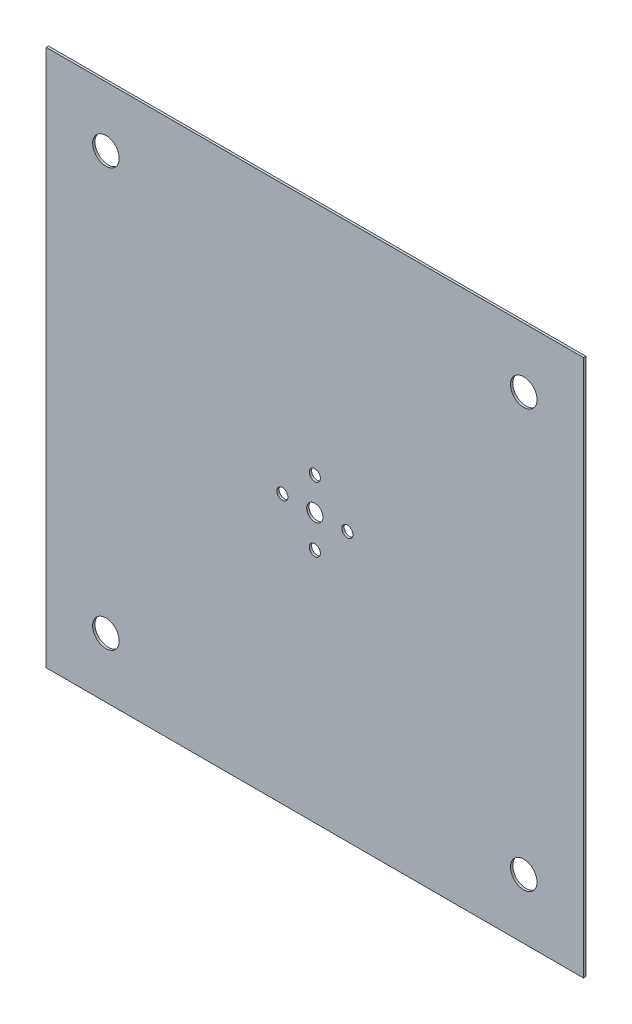
ISO-10303-21;
HEADER;
FILE_DESCRIPTION(('STEP AP214'),'2;1');
FILE_NAME('part.step','',(''),(''),'','','');
FILE_SCHEMA(('AUTOMOTIVE_DESIGN { 1 0 10303 214 1 1 1 1 }'));
ENDSEC;
DATA;
#1=APPLICATION_CONTEXT('core data for automotive mechanical design processes');
#2=APPLICATION_PROTOCOL_DEFINITION('international standard','automotive_design',2000,#1);
#3=PRODUCT_CONTEXT('',#1,'mechanical');
#4=PRODUCT('Part','Part','',(#3));
#5=PRODUCT_RELATED_PRODUCT_CATEGORY('part','',(#4));
#6=PRODUCT_DEFINITION_FORMATION('','',#4);
#7=PRODUCT_DEFINITION_CONTEXT('part definition',#1,'design');
#8=PRODUCT_DEFINITION('design','',#6,#7);
#9=PRODUCT_DEFINITION_SHAPE('','',#8);
#10=(LENGTH_UNIT() NAMED_UNIT(*) SI_UNIT(.MILLI.,.METRE.));
#11=(NAMED_UNIT(*) PLANE_ANGLE_UNIT() SI_UNIT($,.RADIAN.));
#12=(NAMED_UNIT(*) SI_UNIT($,.STERADIAN.) SOLID_ANGLE_UNIT());
#13=UNCERTAINTY_MEASURE_WITH_UNIT(LENGTH_MEASURE(1.E-05),#10,'distance_accuracy_value','');
#14=(GEOMETRIC_REPRESENTATION_CONTEXT(3) GLOBAL_UNCERTAINTY_ASSIGNED_CONTEXT((#13)) GLOBAL_UNIT_ASSIGNED_CONTEXT((#10,
#11,#12)) REPRESENTATION_CONTEXT('',''));
#15=CARTESIAN_POINT('',(0.,0.,0.));
#16=DIRECTION('',(0.,0.,1.));
#17=DIRECTION('',(1.,0.,0.));
#18=AXIS2_PLACEMENT_3D('',#15,#16,#17);
#19=CARTESIAN_POINT('',(1157.4,1157.4,10.));
#20=DIRECTION('',(-1.,0.,0.));
#21=DIRECTION('',(0.,-1.,0.));
#22=AXIS2_PLACEMENT_3D('',#19,#20,#21);
#23=PLANE('',#22);
#24=DIRECTION('',(0.,1.,0.));
#25=VECTOR('',#24,1.);
#26=CARTESIAN_POINT('',(1157.4,1157.4,0.));
#27=LINE('',#26,#25);
#28=CARTESIAN_POINT('',(1157.4,-1157.4,0.));
#29=VERTEX_POINT('',#28);
#30=CARTESIAN_POINT('',(1157.4,1157.4,0.));
#31=VERTEX_POINT('',#30);
#32=EDGE_CURVE('E102',#29,#31,#27,.T.);
#33=ORIENTED_EDGE('',*,*,#32,.T.);
#34=DIRECTION('',(0.,0.,-1.));
#35=VECTOR('',#34,1.);
#36=CARTESIAN_POINT('',(1157.4,1157.4,10.));
#37=LINE('',#36,#35);
#38=CARTESIAN_POINT('',(1157.4,1157.4,10.));
#39=VERTEX_POINT('',#38);
#40=EDGE_CURVE('E11',#39,#31,#37,.T.);
#41=ORIENTED_EDGE('',*,*,#40,.F.);
#42=DIRECTION('',(0.,1.,0.));
#43=VECTOR('',#42,1.);
#44=CARTESIAN_POINT('',(1157.4,1157.4,10.));
#45=LINE('',#44,#43);
#46=CARTESIAN_POINT('',(1157.4,-1157.4,10.));
#47=VERTEX_POINT('',#46);
#48=EDGE_CURVE('E90',#47,#39,#45,.T.);
#49=ORIENTED_EDGE('',*,*,#48,.F.);
#50=DIRECTION('',(0.,0.,-1.));
#51=VECTOR('',#50,1.);
#52=CARTESIAN_POINT('',(1157.4,-1157.4,10.));
#53=LINE('',#52,#51);
#54=EDGE_CURVE('E98',#47,#29,#53,.T.);
#55=ORIENTED_EDGE('',*,*,#54,.T.);
#56=EDGE_LOOP('',(#33,#41,#49,#55));
#57=FACE_BOUND('',#56,.T.);
#58=ADVANCED_FACE('F39',(#57),#23,.F.);
#59=CARTESIAN_POINT('',(-1157.4,1157.4,10.));
#60=DIRECTION('',(0.,-1.,0.));
#61=DIRECTION('',(0.,0.,-1.));
#62=AXIS2_PLACEMENT_3D('',#59,#60,#61);
#63=PLANE('',#62);
#64=DIRECTION('',(-1.,0.,0.));
#65=VECTOR('',#64,1.);
#66=CARTESIAN_POINT('',(-1157.4,1157.4,0.));
#67=LINE('',#66,#65);
#68=CARTESIAN_POINT('',(-1157.4,1157.4,0.));
#69=VERTEX_POINT('',#68);
#70=EDGE_CURVE('E94',#31,#69,#67,.T.);
#71=ORIENTED_EDGE('',*,*,#70,.T.);
#72=DIRECTION('',(0.,0.,-1.));
#73=VECTOR('',#72,1.);
#74=CARTESIAN_POINT('',(-1157.4,1157.4,10.));
#75=LINE('',#74,#73);
#76=CARTESIAN_POINT('',(-1157.4,1157.4,10.));
#77=VERTEX_POINT('',#76);
#78=EDGE_CURVE('E47',#77,#69,#75,.T.);
#79=ORIENTED_EDGE('',*,*,#78,.F.);
#80=DIRECTION('',(-1.,0.,0.));
#81=VECTOR('',#80,1.);
#82=CARTESIAN_POINT('',(-1157.4,1157.4,10.));
#83=LINE('',#82,#81);
#84=EDGE_CURVE('E85',#39,#77,#83,.T.);
#85=ORIENTED_EDGE('',*,*,#84,.F.);
#86=ORIENTED_EDGE('',*,*,#40,.T.);
#87=EDGE_LOOP('',(#71,#79,#85,#86));
#88=FACE_BOUND('',#87,.T.);
#89=ADVANCED_FACE('F93',(#88),#63,.F.);
#90=CARTESIAN_POINT('',(-1157.4,1157.4,10.));
#91=DIRECTION('',(1.,0.,0.));
#92=DIRECTION('',(0.,1.,0.));
#93=AXIS2_PLACEMENT_3D('',#90,#91,#92);
#94=PLANE('',#93);
#95=DIRECTION('',(0.,-1.,0.));
#96=VECTOR('',#95,1.);
#97=CARTESIAN_POINT('',(-1157.4,1157.4,0.));
#98=LINE('',#97,#96);
#99=CARTESIAN_POINT('',(-1157.4,-1157.4,0.));
#100=VERTEX_POINT('',#99);
#101=EDGE_CURVE('E72',#69,#100,#98,.T.);
#102=ORIENTED_EDGE('',*,*,#101,.T.);
#103=DIRECTION('',(0.,0.,-1.));
#104=VECTOR('',#103,1.);
#105=CARTESIAN_POINT('',(-1157.4,-1157.4,10.));
#106=LINE('',#105,#104);
#107=CARTESIAN_POINT('',(-1157.4,-1157.4,10.));
#108=VERTEX_POINT('',#107);
#109=EDGE_CURVE('E95',#108,#100,#106,.T.);
#110=ORIENTED_EDGE('',*,*,#109,.F.);
#111=DIRECTION('',(0.,-1.,0.));
#112=VECTOR('',#111,1.);
#113=CARTESIAN_POINT('',(-1157.4,1157.4,10.));
#114=LINE('',#113,#112);
#115=EDGE_CURVE('E88',#77,#108,#114,.T.);
#116=ORIENTED_EDGE('',*,*,#115,.F.);
#117=ORIENTED_EDGE('',*,*,#78,.T.);
#118=EDGE_LOOP('',(#102,#110,#116,#117));
#119=FACE_BOUND('',#118,.T.);
#120=ADVANCED_FACE('F96',(#119),#94,.F.);
#121=CARTESIAN_POINT('',(-1157.4,-1157.4,10.));
#122=DIRECTION('',(0.,1.,0.));
#123=DIRECTION('',(0.,0.,1.));
#124=AXIS2_PLACEMENT_3D('',#121,#122,#123);
#125=PLANE('',#124);
#126=DIRECTION('',(1.,0.,0.));
#127=VECTOR('',#126,1.);
#128=CARTESIAN_POINT('',(-1157.4,-1157.4,0.));
#129=LINE('',#128,#127);
#130=EDGE_CURVE('E78',#100,#29,#129,.T.);
#131=ORIENTED_EDGE('',*,*,#130,.T.);
#132=ORIENTED_EDGE('',*,*,#54,.F.);
#133=DIRECTION('',(1.,0.,0.));
#134=VECTOR('',#133,1.);
#135=CARTESIAN_POINT('',(-1157.4,-1157.4,10.));
#136=LINE('',#135,#134);
#137=EDGE_CURVE('E55',#108,#47,#136,.T.);
#138=ORIENTED_EDGE('',*,*,#137,.F.);
#139=ORIENTED_EDGE('',*,*,#109,.T.);
#140=EDGE_LOOP('',(#131,#132,#138,#139));
#141=FACE_BOUND('',#140,.T.);
#142=ADVANCED_FACE('F110',(#141),#125,.F.);
#143=CARTESIAN_POINT('',(0.,0.,10.));
#144=DIRECTION('',(0.,0.,1.));
#145=DIRECTION('',(1.,0.,0.));
#146=AXIS2_PLACEMENT_3D('',#143,#144,#145);
#147=PLANE('',#146);
#148=CARTESIAN_POINT('',(-140.,-1.38777878078145E-13,10.));
#149=DIRECTION('',(0.,0.,1.));
#150=DIRECTION('',(-1.,0.,0.));
#151=AXIS2_PLACEMENT_3D('',#148,#149,#150);
#152=CIRCLE('',#151,23.9);
#153=CARTESIAN_POINT('',(-163.9,-1.38777878078145E-13,10.));
#154=VERTEX_POINT('',#153);
#155=EDGE_CURVE('E137',#154,#154,#152,.T.);
#156=ORIENTED_EDGE('',*,*,#155,.F.);
#157=EDGE_LOOP('',(#156));
#158=FACE_BOUND('',#157,.T.);
#159=CARTESIAN_POINT('',(140.,0.,10.));
#160=DIRECTION('',(0.,0.,1.));
#161=DIRECTION('',(1.,0.,0.));
#162=AXIS2_PLACEMENT_3D('',#159,#160,#161);
#163=CIRCLE('',#162,23.9);
#164=CARTESIAN_POINT('',(163.9,0.,10.));
#165=VERTEX_POINT('',#164);
#166=EDGE_CURVE('E126',#165,#165,#163,.T.);
#167=ORIENTED_EDGE('',*,*,#166,.F.);
#168=EDGE_LOOP('',(#167));
#169=FACE_BOUND('',#168,.T.);
#170=CARTESIAN_POINT('',(1.24595565345252E-13,-140.,10.));
#171=DIRECTION('',(0.,0.,1.));
#172=DIRECTION('',(-1.,0.,0.));
#173=AXIS2_PLACEMENT_3D('',#170,#171,#172);
#174=CIRCLE('',#173,23.9);
#175=CARTESIAN_POINT('',(-23.8999999999999,-140.,10.));
#176=VERTEX_POINT('',#175);
#177=EDGE_CURVE('E125',#176,#176,#174,.T.);
#178=ORIENTED_EDGE('',*,*,#177,.F.);
#179=EDGE_LOOP('',(#178));
#180=FACE_BOUND('',#179,.T.);
#181=CARTESIAN_POINT('',(1.24595565345252E-13,140.,10.));
#182=DIRECTION('',(0.,0.,1.));
#183=DIRECTION('',(1.,0.,0.));
#184=AXIS2_PLACEMENT_3D('',#181,#182,#183);
#185=CIRCLE('',#184,23.9);
#186=CARTESIAN_POINT('',(23.9000000000001,140.,10.));
#187=VERTEX_POINT('',#186);
#188=EDGE_CURVE('E119',#187,#187,#185,.T.);
#189=ORIENTED_EDGE('',*,*,#188,.F.);
#190=EDGE_LOOP('',(#189));
#191=FACE_BOUND('',#190,.T.);
#192=CARTESIAN_POINT('',(-900.,900.,10.));
#193=DIRECTION('',(0.,0.,1.));
#194=DIRECTION('',(1.,0.,0.));
#195=AXIS2_PLACEMENT_3D('',#192,#193,#194);
#196=CIRCLE('',#195,57.15);
#197=CARTESIAN_POINT('',(-842.85,900.,10.));
#198=VERTEX_POINT('',#197);
#199=EDGE_CURVE('E138',#198,#198,#196,.T.);
#200=ORIENTED_EDGE('',*,*,#199,.F.);
#201=EDGE_LOOP('',(#200));
#202=FACE_BOUND('',#201,.T.);
#203=CARTESIAN_POINT('',(900.,900.,10.));
#204=DIRECTION('',(0.,0.,1.));
#205=DIRECTION('',(-1.,0.,0.));
#206=AXIS2_PLACEMENT_3D('',#203,#204,#205);
#207=CIRCLE('',#206,57.15);
#208=CARTESIAN_POINT('',(842.85,900.,10.));
#209=VERTEX_POINT('',#208);
#210=EDGE_CURVE('E161',#209,#209,#207,.T.);
#211=ORIENTED_EDGE('',*,*,#210,.F.);
#212=EDGE_LOOP('',(#211));
#213=FACE_BOUND('',#212,.T.);
#214=CARTESIAN_POINT('',(900.,-900.000000000001,10.));
#215=DIRECTION('',(0.,0.,1.));
#216=DIRECTION('',(1.,0.,0.));
#217=AXIS2_PLACEMENT_3D('',#214,#215,#216);
#218=CIRCLE('',#217,57.15);
#219=CARTESIAN_POINT('',(957.15,-900.000000000001,10.));
#220=VERTEX_POINT('',#219);
#221=EDGE_CURVE('E155',#220,#220,#218,.T.);
#222=ORIENTED_EDGE('',*,*,#221,.F.);
#223=EDGE_LOOP('',(#222));
#224=FACE_BOUND('',#223,.T.);
#225=CARTESIAN_POINT('',(-900.,-900.,10.));
#226=DIRECTION('',(0.,0.,1.));
#227=DIRECTION('',(-1.,0.,0.));
#228=AXIS2_PLACEMENT_3D('',#225,#226,#227);
#229=CIRCLE('',#228,57.15);
#230=CARTESIAN_POINT('',(-957.15,-900.,10.));
#231=VERTEX_POINT('',#230);
#232=EDGE_CURVE('E149',#231,#231,#229,.T.);
#233=ORIENTED_EDGE('',*,*,#232,.F.);
#234=EDGE_LOOP('',(#233));
#235=FACE_BOUND('',#234,.T.);
#236=CARTESIAN_POINT('',(0.,0.,10.));
#237=DIRECTION('',(0.,0.,1.));
#238=DIRECTION('',(1.,0.,0.));
#239=AXIS2_PLACEMENT_3D('',#236,#237,#238);
#240=CIRCLE('',#239,35.);
#241=CARTESIAN_POINT('',(35.,0.,10.));
#242=VERTEX_POINT('',#241);
#243=EDGE_CURVE('E116',#242,#242,#240,.T.);
#244=ORIENTED_EDGE('',*,*,#243,.F.);
#245=EDGE_LOOP('',(#244));
#246=FACE_BOUND('',#245,.T.);
#247=ORIENTED_EDGE('',*,*,#48,.T.);
#248=ORIENTED_EDGE('',*,*,#84,.T.);
#249=ORIENTED_EDGE('',*,*,#115,.T.);
#250=ORIENTED_EDGE('',*,*,#137,.T.);
#251=EDGE_LOOP('',(#247,#248,#249,#250));
#252=FACE_BOUND('',#251,.T.);
#253=ADVANCED_FACE('F86',(#158,#169,#180,#191,#202,#213,#224,#235,#246,#252),#147,.T.);
#254=CARTESIAN_POINT('',(0.,0.,0.));
#255=DIRECTION('',(0.,0.,1.));
#256=DIRECTION('',(1.,0.,0.));
#257=AXIS2_PLACEMENT_3D('',#254,#255,#256);
#258=PLANE('',#257);
#259=CARTESIAN_POINT('',(-140.,-1.38777878078145E-13,0.));
#260=DIRECTION('',(0.,0.,1.));
#261=DIRECTION('',(-1.,0.,0.));
#262=AXIS2_PLACEMENT_3D('',#259,#260,#261);
#263=CIRCLE('',#262,23.9);
#264=CARTESIAN_POINT('',(-163.9,-1.38777878078145E-13,0.));
#265=VERTEX_POINT('',#264);
#266=EDGE_CURVE('E134',#265,#265,#263,.T.);
#267=ORIENTED_EDGE('',*,*,#266,.T.);
#268=EDGE_LOOP('',(#267));
#269=FACE_BOUND('',#268,.T.);
#270=CARTESIAN_POINT('',(140.,0.,0.));
#271=DIRECTION('',(0.,0.,1.));
#272=DIRECTION('',(1.,0.,0.));
#273=AXIS2_PLACEMENT_3D('',#270,#271,#272);
#274=CIRCLE('',#273,23.9);
#275=CARTESIAN_POINT('',(163.9,0.,0.));
#276=VERTEX_POINT('',#275);
#277=EDGE_CURVE('E141',#276,#276,#274,.T.);
#278=ORIENTED_EDGE('',*,*,#277,.T.);
#279=EDGE_LOOP('',(#278));
#280=FACE_BOUND('',#279,.T.);
#281=CARTESIAN_POINT('',(1.24595565345252E-13,-140.,0.));
#282=DIRECTION('',(0.,0.,1.));
#283=DIRECTION('',(-1.,0.,0.));
#284=AXIS2_PLACEMENT_3D('',#281,#282,#283);
#285=CIRCLE('',#284,23.9);
#286=CARTESIAN_POINT('',(-23.8999999999999,-140.,0.));
#287=VERTEX_POINT('',#286);
#288=EDGE_CURVE('E122',#287,#287,#285,.T.);
#289=ORIENTED_EDGE('',*,*,#288,.T.);
#290=EDGE_LOOP('',(#289));
#291=FACE_BOUND('',#290,.T.);
#292=CARTESIAN_POINT('',(1.24595565345252E-13,140.,0.));
#293=DIRECTION('',(0.,0.,1.));
#294=DIRECTION('',(1.,0.,0.));
#295=AXIS2_PLACEMENT_3D('',#292,#293,#294);
#296=CIRCLE('',#295,23.9);
#297=CARTESIAN_POINT('',(23.9000000000001,140.,0.));
#298=VERTEX_POINT('',#297);
#299=EDGE_CURVE('E129',#298,#298,#296,.T.);
#300=ORIENTED_EDGE('',*,*,#299,.T.);
#301=EDGE_LOOP('',(#300));
#302=FACE_BOUND('',#301,.T.);
#303=CARTESIAN_POINT('',(-900.,900.,0.));
#304=DIRECTION('',(0.,0.,1.));
#305=DIRECTION('',(1.,0.,0.));
#306=AXIS2_PLACEMENT_3D('',#303,#304,#305);
#307=CIRCLE('',#306,57.15);
#308=CARTESIAN_POINT('',(-842.85,900.,0.));
#309=VERTEX_POINT('',#308);
#310=EDGE_CURVE('E164',#309,#309,#307,.T.);
#311=ORIENTED_EDGE('',*,*,#310,.T.);
#312=EDGE_LOOP('',(#311));
#313=FACE_BOUND('',#312,.T.);
#314=CARTESIAN_POINT('',(900.,900.,0.));
#315=DIRECTION('',(0.,0.,1.));
#316=DIRECTION('',(-1.,0.,0.));
#317=AXIS2_PLACEMENT_3D('',#314,#315,#316);
#318=CIRCLE('',#317,57.15);
#319=CARTESIAN_POINT('',(842.85,900.,0.));
#320=VERTEX_POINT('',#319);
#321=EDGE_CURVE('E158',#320,#320,#318,.T.);
#322=ORIENTED_EDGE('',*,*,#321,.T.);
#323=EDGE_LOOP('',(#322));
#324=FACE_BOUND('',#323,.T.);
#325=CARTESIAN_POINT('',(900.,-900.000000000001,0.));
#326=DIRECTION('',(0.,0.,1.));
#327=DIRECTION('',(1.,0.,0.));
#328=AXIS2_PLACEMENT_3D('',#325,#326,#327);
#329=CIRCLE('',#328,57.15);
#330=CARTESIAN_POINT('',(957.15,-900.000000000001,0.));
#331=VERTEX_POINT('',#330);
#332=EDGE_CURVE('E152',#331,#331,#329,.T.);
#333=ORIENTED_EDGE('',*,*,#332,.T.);
#334=EDGE_LOOP('',(#333));
#335=FACE_BOUND('',#334,.T.);
#336=CARTESIAN_POINT('',(-900.,-900.,0.));
#337=DIRECTION('',(0.,0.,1.));
#338=DIRECTION('',(-1.,0.,0.));
#339=AXIS2_PLACEMENT_3D('',#336,#337,#338);
#340=CIRCLE('',#339,57.15);
#341=CARTESIAN_POINT('',(-957.15,-900.,0.));
#342=VERTEX_POINT('',#341);
#343=EDGE_CURVE('E146',#342,#342,#340,.T.);
#344=ORIENTED_EDGE('',*,*,#343,.T.);
#345=EDGE_LOOP('',(#344));
#346=FACE_BOUND('',#345,.T.);
#347=CARTESIAN_POINT('',(0.,0.,0.));
#348=DIRECTION('',(0.,0.,1.));
#349=DIRECTION('',(1.,0.,0.));
#350=AXIS2_PLACEMENT_3D('',#347,#348,#349);
#351=CIRCLE('',#350,35.);
#352=CARTESIAN_POINT('',(35.,0.,0.));
#353=VERTEX_POINT('',#352);
#354=EDGE_CURVE('E105',#353,#353,#351,.T.);
#355=ORIENTED_EDGE('',*,*,#354,.T.);
#356=EDGE_LOOP('',(#355));
#357=FACE_BOUND('',#356,.T.);
#358=ORIENTED_EDGE('',*,*,#32,.F.);
#359=ORIENTED_EDGE('',*,*,#130,.F.);
#360=ORIENTED_EDGE('',*,*,#101,.F.);
#361=ORIENTED_EDGE('',*,*,#70,.F.);
#362=EDGE_LOOP('',(#358,#359,#360,#361));
#363=FACE_BOUND('',#362,.T.);
#364=ADVANCED_FACE('F113',(#269,#280,#291,#302,#313,#324,#335,#346,#357,#363),#258,.F.);
#365=CARTESIAN_POINT('',(0.,0.,0.));
#366=DIRECTION('',(0.,0.,1.));
#367=DIRECTION('',(1.,0.,0.));
#368=AXIS2_PLACEMENT_3D('',#365,#366,#367);
#369=CYLINDRICAL_SURFACE('',#368,35.);
#370=ORIENTED_EDGE('',*,*,#354,.F.);
#371=EDGE_LOOP('',(#370));
#372=FACE_BOUND('',#371,.T.);
#373=ORIENTED_EDGE('',*,*,#243,.T.);
#374=EDGE_LOOP('',(#373));
#375=FACE_BOUND('',#374,.T.);
#376=ADVANCED_FACE('F184',(#372,#375),#369,.F.);
#377=CARTESIAN_POINT('',(-900.,-900.,0.));
#378=DIRECTION('',(0.,0.,1.));
#379=DIRECTION('',(1.,0.,0.));
#380=AXIS2_PLACEMENT_3D('',#377,#378,#379);
#381=CYLINDRICAL_SURFACE('',#380,57.15);
#382=ORIENTED_EDGE('',*,*,#343,.F.);
#383=EDGE_LOOP('',(#382));
#384=FACE_BOUND('',#383,.T.);
#385=ORIENTED_EDGE('',*,*,#232,.T.);
#386=EDGE_LOOP('',(#385));
#387=FACE_BOUND('',#386,.T.);
#388=ADVANCED_FACE('F186',(#384,#387),#381,.F.);
#389=CARTESIAN_POINT('',(900.,-900.000000000001,0.));
#390=DIRECTION('',(0.,0.,1.));
#391=DIRECTION('',(1.,0.,0.));
#392=AXIS2_PLACEMENT_3D('',#389,#390,#391);
#393=CYLINDRICAL_SURFACE('',#392,57.15);
#394=ORIENTED_EDGE('',*,*,#332,.F.);
#395=EDGE_LOOP('',(#394));
#396=FACE_BOUND('',#395,.T.);
#397=ORIENTED_EDGE('',*,*,#221,.T.);
#398=EDGE_LOOP('',(#397));
#399=FACE_BOUND('',#398,.T.);
#400=ADVANCED_FACE('F193',(#396,#399),#393,.F.);
#401=CARTESIAN_POINT('',(900.,900.,0.));
#402=DIRECTION('',(0.,0.,1.));
#403=DIRECTION('',(1.,0.,0.));
#404=AXIS2_PLACEMENT_3D('',#401,#402,#403);
#405=CYLINDRICAL_SURFACE('',#404,57.15);
#406=ORIENTED_EDGE('',*,*,#321,.F.);
#407=EDGE_LOOP('',(#406));
#408=FACE_BOUND('',#407,.T.);
#409=ORIENTED_EDGE('',*,*,#210,.T.);
#410=EDGE_LOOP('',(#409));
#411=FACE_BOUND('',#410,.T.);
#412=ADVANCED_FACE('F247',(#408,#411),#405,.F.);
#413=CARTESIAN_POINT('',(-900.,900.,0.));
#414=DIRECTION('',(0.,0.,1.));
#415=DIRECTION('',(1.,0.,0.));
#416=AXIS2_PLACEMENT_3D('',#413,#414,#415);
#417=CYLINDRICAL_SURFACE('',#416,57.15);
#418=ORIENTED_EDGE('',*,*,#310,.F.);
#419=EDGE_LOOP('',(#418));
#420=FACE_BOUND('',#419,.T.);
#421=ORIENTED_EDGE('',*,*,#199,.T.);
#422=EDGE_LOOP('',(#421));
#423=FACE_BOUND('',#422,.T.);
#424=ADVANCED_FACE('F170',(#420,#423),#417,.F.);
#425=CARTESIAN_POINT('',(1.24595565345252E-13,140.,0.));
#426=DIRECTION('',(0.,0.,1.));
#427=DIRECTION('',(1.,0.,0.));
#428=AXIS2_PLACEMENT_3D('',#425,#426,#427);
#429=CYLINDRICAL_SURFACE('',#428,23.9);
#430=ORIENTED_EDGE('',*,*,#299,.F.);
#431=EDGE_LOOP('',(#430));
#432=FACE_BOUND('',#431,.T.);
#433=ORIENTED_EDGE('',*,*,#188,.T.);
#434=EDGE_LOOP('',(#433));
#435=FACE_BOUND('',#434,.T.);
#436=ADVANCED_FACE('F268',(#432,#435),#429,.F.);
#437=CARTESIAN_POINT('',(1.24595565345252E-13,-140.,0.));
#438=DIRECTION('',(0.,0.,1.));
#439=DIRECTION('',(1.,0.,0.));
#440=AXIS2_PLACEMENT_3D('',#437,#438,#439);
#441=CYLINDRICAL_SURFACE('',#440,23.9);
#442=ORIENTED_EDGE('',*,*,#288,.F.);
#443=EDGE_LOOP('',(#442));
#444=FACE_BOUND('',#443,.T.);
#445=ORIENTED_EDGE('',*,*,#177,.T.);
#446=EDGE_LOOP('',(#445));
#447=FACE_BOUND('',#446,.T.);
#448=ADVANCED_FACE('F279',(#444,#447),#441,.F.);
#449=CARTESIAN_POINT('',(140.,0.,0.));
#450=DIRECTION('',(0.,0.,1.));
#451=DIRECTION('',(1.,0.,0.));
#452=AXIS2_PLACEMENT_3D('',#449,#450,#451);
#453=CYLINDRICAL_SURFACE('',#452,23.9);
#454=ORIENTED_EDGE('',*,*,#277,.F.);
#455=EDGE_LOOP('',(#454));
#456=FACE_BOUND('',#455,.T.);
#457=ORIENTED_EDGE('',*,*,#166,.T.);
#458=EDGE_LOOP('',(#457));
#459=FACE_BOUND('',#458,.T.);
#460=ADVANCED_FACE('F290',(#456,#459),#453,.F.);
#461=CARTESIAN_POINT('',(-140.,-1.38777878078145E-13,0.));
#462=DIRECTION('',(0.,0.,1.));
#463=DIRECTION('',(1.,0.,0.));
#464=AXIS2_PLACEMENT_3D('',#461,#462,#463);
#465=CYLINDRICAL_SURFACE('',#464,23.9);
#466=ORIENTED_EDGE('',*,*,#266,.F.);
#467=EDGE_LOOP('',(#466));
#468=FACE_BOUND('',#467,.T.);
#469=ORIENTED_EDGE('',*,*,#155,.T.);
#470=EDGE_LOOP('',(#469));
#471=FACE_BOUND('',#470,.T.);
#472=ADVANCED_FACE('F300',(#468,#471),#465,.F.);
#473=CLOSED_SHELL('',(#58,#89,#120,#142,#253,#364,#376,#388,#400,#412,#424,#436,#448,#460,#472));
#474=MANIFOLD_SOLID_BREP('B2',#473);
#475=ADVANCED_BREP_SHAPE_REPRESENTATION('',(#18,#474),#14);
#476=SHAPE_DEFINITION_REPRESENTATION(#9,#475);
ENDSEC;
END-ISO-10303-21;
